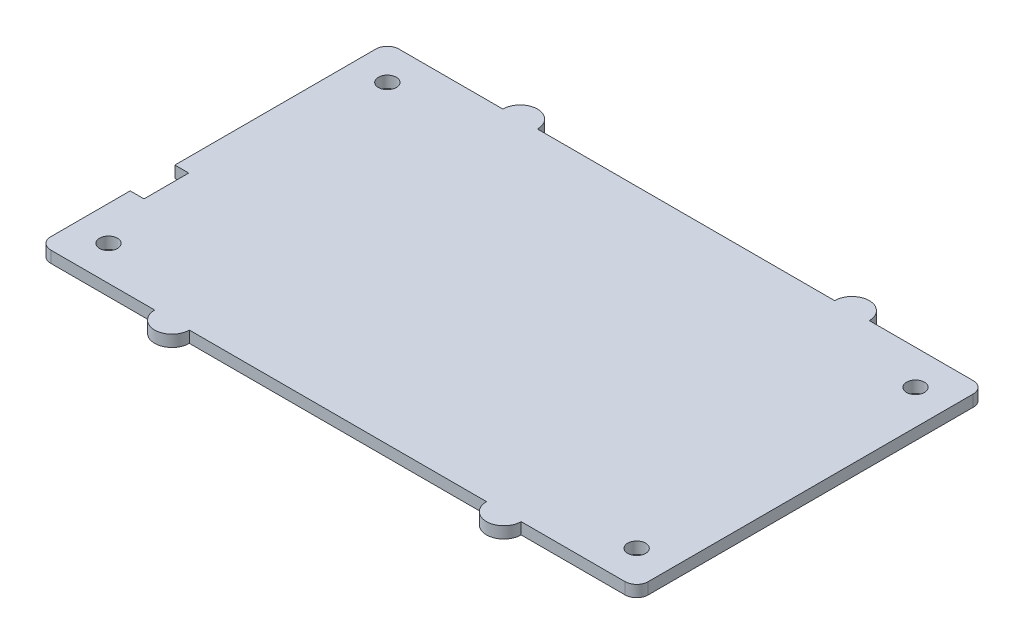
ISO-10303-21;
HEADER;
FILE_DESCRIPTION(('STEP AP214'),'2;1');
FILE_NAME('part.step','',(''),(''),'','','');
FILE_SCHEMA(('AUTOMOTIVE_DESIGN { 1 0 10303 214 1 1 1 1 }'));
ENDSEC;
DATA;
#1=APPLICATION_CONTEXT('core data for automotive mechanical design processes');
#2=APPLICATION_PROTOCOL_DEFINITION('international standard','automotive_design',2000,#1);
#3=PRODUCT_CONTEXT('',#1,'mechanical');
#4=PRODUCT('Part','Part','',(#3));
#5=PRODUCT_RELATED_PRODUCT_CATEGORY('part','',(#4));
#6=PRODUCT_DEFINITION_FORMATION('','',#4);
#7=PRODUCT_DEFINITION_CONTEXT('part definition',#1,'design');
#8=PRODUCT_DEFINITION('design','',#6,#7);
#9=PRODUCT_DEFINITION_SHAPE('','',#8);
#10=(LENGTH_UNIT() NAMED_UNIT(*) SI_UNIT(.MILLI.,.METRE.));
#11=(NAMED_UNIT(*) PLANE_ANGLE_UNIT() SI_UNIT($,.RADIAN.));
#12=(NAMED_UNIT(*) SI_UNIT($,.STERADIAN.) SOLID_ANGLE_UNIT());
#13=UNCERTAINTY_MEASURE_WITH_UNIT(LENGTH_MEASURE(1.E-05),#10,'distance_accuracy_value','');
#14=(GEOMETRIC_REPRESENTATION_CONTEXT(3) GLOBAL_UNCERTAINTY_ASSIGNED_CONTEXT((#13)) GLOBAL_UNIT_ASSIGNED_CONTEXT((#10,
#11,#12)) REPRESENTATION_CONTEXT('',''));
#15=CARTESIAN_POINT('',(0.,0.,0.));
#16=DIRECTION('',(0.,0.,1.));
#17=DIRECTION('',(1.,0.,0.));
#18=AXIS2_PLACEMENT_3D('',#15,#16,#17);
#19=CARTESIAN_POINT('',(0.,2.,0.));
#20=DIRECTION('',(0.,-1.,0.));
#21=DIRECTION('',(0.,0.,-1.));
#22=AXIS2_PLACEMENT_3D('',#19,#20,#21);
#23=CYLINDRICAL_SURFACE('',#22,1.55);
#24=CARTESIAN_POINT('',(0.,2.,0.));
#25=DIRECTION('',(0.,1.,0.));
#26=DIRECTION('',(0.,0.,1.));
#27=AXIS2_PLACEMENT_3D('',#24,#25,#26);
#28=CIRCLE('',#27,1.55);
#29=CARTESIAN_POINT('',(0.,2.,1.55));
#30=VERTEX_POINT('',#29);
#31=EDGE_CURVE('E473',#30,#30,#28,.T.);
#32=ORIENTED_EDGE('',*,*,#31,.T.);
#33=EDGE_LOOP('',(#32));
#34=FACE_BOUND('',#33,.T.);
#35=CARTESIAN_POINT('',(0.,0.,0.));
#36=DIRECTION('',(0.,1.,0.));
#37=DIRECTION('',(0.,0.,1.));
#38=AXIS2_PLACEMENT_3D('',#35,#36,#37);
#39=CIRCLE('',#38,1.55);
#40=CARTESIAN_POINT('',(0.,0.,1.55));
#41=VERTEX_POINT('',#40);
#42=EDGE_CURVE('E458',#41,#41,#39,.T.);
#43=ORIENTED_EDGE('',*,*,#42,.F.);
#44=EDGE_LOOP('',(#43));
#45=FACE_BOUND('',#44,.T.);
#46=ADVANCED_FACE('F287',(#34,#45),#23,.F.);
#47=CARTESIAN_POINT('',(91.46,2.,0.));
#48=DIRECTION('',(0.,-1.,0.));
#49=DIRECTION('',(0.,0.,-1.));
#50=AXIS2_PLACEMENT_3D('',#47,#48,#49);
#51=CYLINDRICAL_SURFACE('',#50,1.54999999999999);
#52=CARTESIAN_POINT('',(91.46,2.,0.));
#53=DIRECTION('',(0.,1.,0.));
#54=DIRECTION('',(0.,0.,1.));
#55=AXIS2_PLACEMENT_3D('',#52,#53,#54);
#56=CIRCLE('',#55,1.54999999999999);
#57=CARTESIAN_POINT('',(91.46,2.,1.54999999999999));
#58=VERTEX_POINT('',#57);
#59=EDGE_CURVE('E890',#58,#58,#56,.T.);
#60=ORIENTED_EDGE('',*,*,#59,.T.);
#61=EDGE_LOOP('',(#60));
#62=FACE_BOUND('',#61,.T.);
#63=CARTESIAN_POINT('',(91.46,0.,0.));
#64=DIRECTION('',(0.,1.,0.));
#65=DIRECTION('',(0.,0.,1.));
#66=AXIS2_PLACEMENT_3D('',#63,#64,#65);
#67=CIRCLE('',#66,1.54999999999999);
#68=CARTESIAN_POINT('',(91.46,0.,1.54999999999999));
#69=VERTEX_POINT('',#68);
#70=EDGE_CURVE('E463',#69,#69,#67,.T.);
#71=ORIENTED_EDGE('',*,*,#70,.F.);
#72=EDGE_LOOP('',(#71));
#73=FACE_BOUND('',#72,.T.);
#74=ADVANCED_FACE('F565',(#62,#73),#51,.F.);
#75=CARTESIAN_POINT('',(91.4599999999998,2.,-48.29));
#76=DIRECTION('',(0.,-1.,0.));
#77=DIRECTION('',(0.,0.,-1.));
#78=AXIS2_PLACEMENT_3D('',#75,#76,#77);
#79=CYLINDRICAL_SURFACE('',#78,1.55);
#80=CARTESIAN_POINT('',(91.4599999999998,2.,-48.29));
#81=DIRECTION('',(0.,1.,0.));
#82=DIRECTION('',(0.,0.,1.));
#83=AXIS2_PLACEMENT_3D('',#80,#81,#82);
#84=CIRCLE('',#83,1.55);
#85=CARTESIAN_POINT('',(91.4599999999998,2.,-46.74));
#86=VERTEX_POINT('',#85);
#87=EDGE_CURVE('E888',#86,#86,#84,.T.);
#88=ORIENTED_EDGE('',*,*,#87,.T.);
#89=EDGE_LOOP('',(#88));
#90=FACE_BOUND('',#89,.T.);
#91=CARTESIAN_POINT('',(91.4599999999998,0.,-48.29));
#92=DIRECTION('',(0.,1.,0.));
#93=DIRECTION('',(0.,0.,1.));
#94=AXIS2_PLACEMENT_3D('',#91,#92,#93);
#95=CIRCLE('',#94,1.55);
#96=CARTESIAN_POINT('',(91.4599999999998,0.,-46.74));
#97=VERTEX_POINT('',#96);
#98=EDGE_CURVE('E468',#97,#97,#95,.T.);
#99=ORIENTED_EDGE('',*,*,#98,.F.);
#100=EDGE_LOOP('',(#99));
#101=FACE_BOUND('',#100,.T.);
#102=ADVANCED_FACE('F562',(#90,#101),#79,.F.);
#103=CARTESIAN_POINT('',(-1.65646724156194E-13,2.,-48.29));
#104=DIRECTION('',(0.,-1.,0.));
#105=DIRECTION('',(0.,0.,-1.));
#106=AXIS2_PLACEMENT_3D('',#103,#104,#105);
#107=CYLINDRICAL_SURFACE('',#106,1.55);
#108=CARTESIAN_POINT('',(-1.65646724156194E-13,2.,-48.29));
#109=DIRECTION('',(0.,1.,0.));
#110=DIRECTION('',(0.,0.,1.));
#111=AXIS2_PLACEMENT_3D('',#108,#109,#110);
#112=CIRCLE('',#111,1.55);
#113=CARTESIAN_POINT('',(-1.65646724156194E-13,2.,-46.74));
#114=VERTEX_POINT('',#113);
#115=EDGE_CURVE('E453',#114,#114,#112,.T.);
#116=ORIENTED_EDGE('',*,*,#115,.T.);
#117=EDGE_LOOP('',(#116));
#118=FACE_BOUND('',#117,.T.);
#119=CARTESIAN_POINT('',(-1.65646724156194E-13,0.,-48.29));
#120=DIRECTION('',(0.,1.,0.));
#121=DIRECTION('',(0.,0.,1.));
#122=AXIS2_PLACEMENT_3D('',#119,#120,#121);
#123=CIRCLE('',#122,1.55);
#124=CARTESIAN_POINT('',(-1.65646724156194E-13,0.,-46.74));
#125=VERTEX_POINT('',#124);
#126=EDGE_CURVE('E544',#125,#125,#123,.T.);
#127=ORIENTED_EDGE('',*,*,#126,.F.);
#128=EDGE_LOOP('',(#127));
#129=FACE_BOUND('',#128,.T.);
#130=ADVANCED_FACE('F564',(#118,#129),#107,.F.);
#131=CARTESIAN_POINT('',(0.,2.,6.));
#132=DIRECTION('',(0.,0.,-1.));
#133=DIRECTION('',(-1.,0.,0.));
#134=AXIS2_PLACEMENT_3D('',#131,#132,#133);
#135=PLANE('',#134);
#136=DIRECTION('',(1.,0.,0.));
#137=VECTOR('',#136,1.);
#138=CARTESIAN_POINT('',(0.,0.,6.));
#139=LINE('',#138,#137);
#140=CARTESIAN_POINT('',(77.46,0.,5.99999999999999));
#141=VERTEX_POINT('',#140);
#142=CARTESIAN_POINT('',(95.46,0.,5.99999999999998));
#143=VERTEX_POINT('',#142);
#144=EDGE_CURVE('E517',#141,#143,#139,.T.);
#145=ORIENTED_EDGE('',*,*,#144,.T.);
#146=DIRECTION('',(0.,-1.,0.));
#147=VECTOR('',#146,1.);
#148=CARTESIAN_POINT('',(95.46,2.,5.99999999999998));
#149=LINE('',#148,#147);
#150=CARTESIAN_POINT('',(95.46,2.,5.99999999999998));
#151=VERTEX_POINT('',#150);
#152=EDGE_CURVE('E297',#151,#143,#149,.T.);
#153=ORIENTED_EDGE('',*,*,#152,.F.);
#154=DIRECTION('',(1.,0.,0.));
#155=VECTOR('',#154,1.);
#156=CARTESIAN_POINT('',(0.,2.,6.));
#157=LINE('',#156,#155);
#158=CARTESIAN_POINT('',(77.46,2.,5.99999999999999));
#159=VERTEX_POINT('',#158);
#160=EDGE_CURVE('E452',#159,#151,#157,.T.);
#161=ORIENTED_EDGE('',*,*,#160,.F.);
#162=DIRECTION('',(0.,-1.,0.));
#163=VECTOR('',#162,1.);
#164=CARTESIAN_POINT('',(77.46,2.,5.99999999999999));
#165=LINE('',#164,#163);
#166=EDGE_CURVE('E12',#159,#141,#165,.T.);
#167=ORIENTED_EDGE('',*,*,#166,.T.);
#168=EDGE_LOOP('',(#145,#153,#161,#167));
#169=FACE_BOUND('',#168,.T.);
#170=ADVANCED_FACE('F572',(#169),#135,.F.);
#171=CARTESIAN_POINT('',(95.46,2.,3.99999999999999));
#172=DIRECTION('',(0.,-1.,0.));
#173=DIRECTION('',(0.,0.,-1.));
#174=AXIS2_PLACEMENT_3D('',#171,#172,#173);
#175=CYLINDRICAL_SURFACE('',#174,2.);
#176=CARTESIAN_POINT('',(95.46,0.,3.99999999999999));
#177=DIRECTION('',(0.,1.,0.));
#178=DIRECTION('',(0.,0.,1.));
#179=AXIS2_PLACEMENT_3D('',#176,#177,#178);
#180=CIRCLE('',#179,2.);
#181=CARTESIAN_POINT('',(97.46,0.,3.99999999999999));
#182=VERTEX_POINT('',#181);
#183=EDGE_CURVE('E537',#143,#182,#180,.T.);
#184=ORIENTED_EDGE('',*,*,#183,.T.);
#185=DIRECTION('',(0.,-1.,0.));
#186=VECTOR('',#185,1.);
#187=CARTESIAN_POINT('',(97.46,2.,3.99999999999999));
#188=LINE('',#187,#186);
#189=CARTESIAN_POINT('',(97.46,2.,3.99999999999999));
#190=VERTEX_POINT('',#189);
#191=EDGE_CURVE('E509',#190,#182,#188,.T.);
#192=ORIENTED_EDGE('',*,*,#191,.F.);
#193=CARTESIAN_POINT('',(95.46,2.,3.99999999999999));
#194=DIRECTION('',(0.,1.,0.));
#195=DIRECTION('',(0.,0.,1.));
#196=AXIS2_PLACEMENT_3D('',#193,#194,#195);
#197=CIRCLE('',#196,2.);
#198=EDGE_CURVE('E457',#151,#190,#197,.T.);
#199=ORIENTED_EDGE('',*,*,#198,.F.);
#200=ORIENTED_EDGE('',*,*,#152,.T.);
#201=EDGE_LOOP('',(#184,#192,#199,#200));
#202=FACE_BOUND('',#201,.T.);
#203=ADVANCED_FACE('F607',(#202),#175,.T.);
#204=CARTESIAN_POINT('',(97.46,2.,0.));
#205=DIRECTION('',(-1.,0.,0.));
#206=DIRECTION('',(0.,0.,1.));
#207=AXIS2_PLACEMENT_3D('',#204,#205,#206);
#208=PLANE('',#207);
#209=DIRECTION('',(0.,0.,-1.));
#210=VECTOR('',#209,1.);
#211=CARTESIAN_POINT('',(97.46,0.,0.));
#212=LINE('',#211,#210);
#213=CARTESIAN_POINT('',(97.46,0.,-52.29));
#214=VERTEX_POINT('',#213);
#215=EDGE_CURVE('E541',#182,#214,#212,.T.);
#216=ORIENTED_EDGE('',*,*,#215,.T.);
#217=DIRECTION('',(0.,-1.,0.));
#218=VECTOR('',#217,1.);
#219=CARTESIAN_POINT('',(97.46,2.,-52.29));
#220=LINE('',#219,#218);
#221=CARTESIAN_POINT('',(97.46,2.,-52.29));
#222=VERTEX_POINT('',#221);
#223=EDGE_CURVE('E506',#222,#214,#220,.T.);
#224=ORIENTED_EDGE('',*,*,#223,.F.);
#225=DIRECTION('',(0.,0.,-1.));
#226=VECTOR('',#225,1.);
#227=CARTESIAN_POINT('',(97.46,2.,0.));
#228=LINE('',#227,#226);
#229=EDGE_CURVE('E461',#190,#222,#228,.T.);
#230=ORIENTED_EDGE('',*,*,#229,.F.);
#231=ORIENTED_EDGE('',*,*,#191,.T.);
#232=EDGE_LOOP('',(#216,#224,#230,#231));
#233=FACE_BOUND('',#232,.T.);
#234=ADVANCED_FACE('F610',(#233),#208,.F.);
#235=CARTESIAN_POINT('',(95.46,2.,-52.29));
#236=DIRECTION('',(0.,-1.,0.));
#237=DIRECTION('',(0.,0.,-1.));
#238=AXIS2_PLACEMENT_3D('',#235,#236,#237);
#239=CYLINDRICAL_SURFACE('',#238,2.);
#240=CARTESIAN_POINT('',(95.46,0.,-52.29));
#241=DIRECTION('',(0.,1.,0.));
#242=DIRECTION('',(0.,0.,1.));
#243=AXIS2_PLACEMENT_3D('',#240,#241,#242);
#244=CIRCLE('',#243,2.);
#245=CARTESIAN_POINT('',(95.46,0.,-54.29));
#246=VERTEX_POINT('',#245);
#247=EDGE_CURVE('E851',#214,#246,#244,.T.);
#248=ORIENTED_EDGE('',*,*,#247,.T.);
#249=DIRECTION('',(0.,-1.,0.));
#250=VECTOR('',#249,1.);
#251=CARTESIAN_POINT('',(95.46,2.,-54.29));
#252=LINE('',#251,#250);
#253=CARTESIAN_POINT('',(95.46,2.,-54.29));
#254=VERTEX_POINT('',#253);
#255=EDGE_CURVE('E503',#254,#246,#252,.T.);
#256=ORIENTED_EDGE('',*,*,#255,.F.);
#257=CARTESIAN_POINT('',(95.46,2.,-52.29));
#258=DIRECTION('',(0.,1.,0.));
#259=DIRECTION('',(0.,0.,1.));
#260=AXIS2_PLACEMENT_3D('',#257,#258,#259);
#261=CIRCLE('',#260,2.);
#262=EDGE_CURVE('E859',#222,#254,#261,.T.);
#263=ORIENTED_EDGE('',*,*,#262,.F.);
#264=ORIENTED_EDGE('',*,*,#223,.T.);
#265=EDGE_LOOP('',(#248,#256,#263,#264));
#266=FACE_BOUND('',#265,.T.);
#267=ADVANCED_FACE('F614',(#266),#239,.T.);
#268=CARTESIAN_POINT('',(0.,2.,-54.29));
#269=DIRECTION('',(0.,0.,1.));
#270=DIRECTION('',(1.,0.,0.));
#271=AXIS2_PLACEMENT_3D('',#268,#269,#270);
#272=PLANE('',#271);
#273=DIRECTION('',(-1.,0.,0.));
#274=VECTOR('',#273,1.);
#275=CARTESIAN_POINT('',(0.,0.,-54.29));
#276=LINE('',#275,#274);
#277=CARTESIAN_POINT('',(77.46,0.,-54.29));
#278=VERTEX_POINT('',#277);
#279=EDGE_CURVE('E847',#246,#278,#276,.T.);
#280=ORIENTED_EDGE('',*,*,#279,.T.);
#281=DIRECTION('',(0.,-1.,0.));
#282=VECTOR('',#281,1.);
#283=CARTESIAN_POINT('',(77.46,2.,-54.29));
#284=LINE('',#283,#282);
#285=CARTESIAN_POINT('',(77.46,2.,-54.29));
#286=VERTEX_POINT('',#285);
#287=EDGE_CURVE('E501',#286,#278,#284,.T.);
#288=ORIENTED_EDGE('',*,*,#287,.F.);
#289=DIRECTION('',(-1.,0.,0.));
#290=VECTOR('',#289,1.);
#291=CARTESIAN_POINT('',(0.,2.,-54.29));
#292=LINE('',#291,#290);
#293=EDGE_CURVE('E866',#254,#286,#292,.T.);
#294=ORIENTED_EDGE('',*,*,#293,.F.);
#295=ORIENTED_EDGE('',*,*,#255,.T.);
#296=EDGE_LOOP('',(#280,#288,#294,#295));
#297=FACE_BOUND('',#296,.T.);
#298=ADVANCED_FACE('F618',(#297),#272,.F.);
#299=CARTESIAN_POINT('',(71.46,0.,-54.29));
#300=VERTEX_POINT('',#299);
#301=CARTESIAN_POINT('',(20.,0.,-54.29));
#302=VERTEX_POINT('',#301);
#303=EDGE_CURVE('E850',#300,#302,#276,.T.);
#304=ORIENTED_EDGE('',*,*,#303,.T.);
#305=DIRECTION('',(0.,-1.,0.));
#306=VECTOR('',#305,1.);
#307=CARTESIAN_POINT('',(20.,2.,-54.29));
#308=LINE('',#307,#306);
#309=CARTESIAN_POINT('',(20.,2.,-54.29));
#310=VERTEX_POINT('',#309);
#311=EDGE_CURVE('E497',#310,#302,#308,.T.);
#312=ORIENTED_EDGE('',*,*,#311,.F.);
#313=CARTESIAN_POINT('',(71.46,2.,-54.29));
#314=VERTEX_POINT('',#313);
#315=EDGE_CURVE('E867',#314,#310,#292,.T.);
#316=ORIENTED_EDGE('',*,*,#315,.F.);
#317=DIRECTION('',(0.,-1.,0.));
#318=VECTOR('',#317,1.);
#319=CARTESIAN_POINT('',(71.46,2.,-54.29));
#320=LINE('',#319,#318);
#321=EDGE_CURVE('E499',#314,#300,#320,.T.);
#322=ORIENTED_EDGE('',*,*,#321,.T.);
#323=EDGE_LOOP('',(#304,#312,#316,#322));
#324=FACE_BOUND('',#323,.T.);
#325=ADVANCED_FACE('F624',(#324),#272,.F.);
#326=CARTESIAN_POINT('',(14.,0.,-54.29));
#327=VERTEX_POINT('',#326);
#328=CARTESIAN_POINT('',(-4.,0.,-54.29));
#329=VERTEX_POINT('',#328);
#330=EDGE_CURVE('E846',#327,#329,#276,.T.);
#331=ORIENTED_EDGE('',*,*,#330,.T.);
#332=DIRECTION('',(0.,-1.,0.));
#333=VECTOR('',#332,1.);
#334=CARTESIAN_POINT('',(-4.,2.,-54.29));
#335=LINE('',#334,#333);
#336=CARTESIAN_POINT('',(-4.,2.,-54.29));
#337=VERTEX_POINT('',#336);
#338=EDGE_CURVE('E492',#337,#329,#335,.T.);
#339=ORIENTED_EDGE('',*,*,#338,.F.);
#340=CARTESIAN_POINT('',(14.,2.,-54.29));
#341=VERTEX_POINT('',#340);
#342=EDGE_CURVE('E869',#341,#337,#292,.T.);
#343=ORIENTED_EDGE('',*,*,#342,.F.);
#344=DIRECTION('',(0.,-1.,0.));
#345=VECTOR('',#344,1.);
#346=CARTESIAN_POINT('',(14.,2.,-54.29));
#347=LINE('',#346,#345);
#348=EDGE_CURVE('E495',#341,#327,#347,.T.);
#349=ORIENTED_EDGE('',*,*,#348,.T.);
#350=EDGE_LOOP('',(#331,#339,#343,#349));
#351=FACE_BOUND('',#350,.T.);
#352=ADVANCED_FACE('F620',(#351),#272,.F.);
#353=CARTESIAN_POINT('',(-4.,2.,-52.29));
#354=DIRECTION('',(0.,-1.,0.));
#355=DIRECTION('',(0.,0.,-1.));
#356=AXIS2_PLACEMENT_3D('',#353,#354,#355);
#357=CYLINDRICAL_SURFACE('',#356,2.);
#358=CARTESIAN_POINT('',(-4.,0.,-52.29));
#359=DIRECTION('',(0.,1.,0.));
#360=DIRECTION('',(0.,0.,1.));
#361=AXIS2_PLACEMENT_3D('',#358,#359,#360);
#362=CIRCLE('',#361,2.);
#363=CARTESIAN_POINT('',(-6.,0.,-52.29));
#364=VERTEX_POINT('',#363);
#365=EDGE_CURVE('E836',#329,#364,#362,.T.);
#366=ORIENTED_EDGE('',*,*,#365,.T.);
#367=DIRECTION('',(0.,-1.,0.));
#368=VECTOR('',#367,1.);
#369=CARTESIAN_POINT('',(-6.,2.,-52.29));
#370=LINE('',#369,#368);
#371=CARTESIAN_POINT('',(-6.,2.,-52.29));
#372=VERTEX_POINT('',#371);
#373=EDGE_CURVE('E489',#372,#364,#370,.T.);
#374=ORIENTED_EDGE('',*,*,#373,.F.);
#375=CARTESIAN_POINT('',(-4.,2.,-52.29));
#376=DIRECTION('',(0.,1.,0.));
#377=DIRECTION('',(0.,0.,1.));
#378=AXIS2_PLACEMENT_3D('',#375,#376,#377);
#379=CIRCLE('',#378,2.);
#380=EDGE_CURVE('E873',#337,#372,#379,.T.);
#381=ORIENTED_EDGE('',*,*,#380,.F.);
#382=ORIENTED_EDGE('',*,*,#338,.T.);
#383=EDGE_LOOP('',(#366,#374,#381,#382));
#384=FACE_BOUND('',#383,.T.);
#385=ADVANCED_FACE('F623',(#384),#357,.T.);
#386=CARTESIAN_POINT('',(-6.,2.,0.));
#387=DIRECTION('',(1.,0.,0.));
#388=DIRECTION('',(0.,0.,-1.));
#389=AXIS2_PLACEMENT_3D('',#386,#387,#388);
#390=PLANE('',#389);
#391=DIRECTION('',(0.,0.,1.));
#392=VECTOR('',#391,1.);
#393=CARTESIAN_POINT('',(-6.,0.,0.));
#394=LINE('',#393,#392);
#395=CARTESIAN_POINT('',(-6.,0.,-17.4938982708781));
#396=VERTEX_POINT('',#395);
#397=EDGE_CURVE('E552',#364,#396,#394,.T.);
#398=ORIENTED_EDGE('',*,*,#397,.T.);
#399=DIRECTION('',(0.,-1.,0.));
#400=VECTOR('',#399,1.);
#401=CARTESIAN_POINT('',(-6.,2.,-17.4938982708781));
#402=LINE('',#401,#400);
#403=CARTESIAN_POINT('',(-6.,2.,-17.4938982708781));
#404=VERTEX_POINT('',#403);
#405=EDGE_CURVE('E486',#404,#396,#402,.T.);
#406=ORIENTED_EDGE('',*,*,#405,.F.);
#407=DIRECTION('',(0.,0.,1.));
#408=VECTOR('',#407,1.);
#409=CARTESIAN_POINT('',(-6.,2.,0.));
#410=LINE('',#409,#408);
#411=EDGE_CURVE('E876',#372,#404,#410,.T.);
#412=ORIENTED_EDGE('',*,*,#411,.F.);
#413=ORIENTED_EDGE('',*,*,#373,.T.);
#414=EDGE_LOOP('',(#398,#406,#412,#413));
#415=FACE_BOUND('',#414,.T.);
#416=ADVANCED_FACE('F628',(#415),#390,.F.);
#417=CARTESIAN_POINT('',(0.,2.,-17.4938982708781));
#418=DIRECTION('',(0.,0.,-1.));
#419=DIRECTION('',(-1.,0.,0.));
#420=AXIS2_PLACEMENT_3D('',#417,#418,#419);
#421=PLANE('',#420);
#422=DIRECTION('',(1.,0.,0.));
#423=VECTOR('',#422,1.);
#424=CARTESIAN_POINT('',(0.,0.,-17.4938982708781));
#425=LINE('',#424,#423);
#426=CARTESIAN_POINT('',(-3.6,0.,-17.4938982708781));
#427=VERTEX_POINT('',#426);
#428=EDGE_CURVE('E835',#396,#427,#425,.T.);
#429=ORIENTED_EDGE('',*,*,#428,.T.);
#430=DIRECTION('',(0.,-1.,0.));
#431=VECTOR('',#430,1.);
#432=CARTESIAN_POINT('',(-3.6,2.,-17.4938982708781));
#433=LINE('',#432,#431);
#434=CARTESIAN_POINT('',(-3.6,2.,-17.4938982708781));
#435=VERTEX_POINT('',#434);
#436=EDGE_CURVE('E483',#435,#427,#433,.T.);
#437=ORIENTED_EDGE('',*,*,#436,.F.);
#438=DIRECTION('',(1.,0.,0.));
#439=VECTOR('',#438,1.);
#440=CARTESIAN_POINT('',(0.,2.,-17.4938982708781));
#441=LINE('',#440,#439);
#442=EDGE_CURVE('E838',#404,#435,#441,.T.);
#443=ORIENTED_EDGE('',*,*,#442,.F.);
#444=ORIENTED_EDGE('',*,*,#405,.T.);
#445=EDGE_LOOP('',(#429,#437,#443,#444));
#446=FACE_BOUND('',#445,.T.);
#447=ADVANCED_FACE('F630',(#446),#421,.F.);
#448=CARTESIAN_POINT('',(-3.59999999999999,2.,0.));
#449=DIRECTION('',(1.,0.,0.));
#450=DIRECTION('',(0.,0.,-1.));
#451=AXIS2_PLACEMENT_3D('',#448,#449,#450);
#452=PLANE('',#451);
#453=DIRECTION('',(0.,0.,1.));
#454=VECTOR('',#453,1.);
#455=CARTESIAN_POINT('',(-3.59999999999999,0.,0.));
#456=LINE('',#455,#454);
#457=CARTESIAN_POINT('',(-3.6,0.,-9.75));
#458=VERTEX_POINT('',#457);
#459=EDGE_CURVE('E842',#427,#458,#456,.T.);
#460=ORIENTED_EDGE('',*,*,#459,.T.);
#461=DIRECTION('',(0.,-1.,0.));
#462=VECTOR('',#461,1.);
#463=CARTESIAN_POINT('',(-3.6,2.,-9.75));
#464=LINE('',#463,#462);
#465=CARTESIAN_POINT('',(-3.6,2.,-9.75));
#466=VERTEX_POINT('',#465);
#467=EDGE_CURVE('E481',#466,#458,#464,.T.);
#468=ORIENTED_EDGE('',*,*,#467,.F.);
#469=DIRECTION('',(0.,0.,1.));
#470=VECTOR('',#469,1.);
#471=CARTESIAN_POINT('',(-3.59999999999999,2.,0.));
#472=LINE('',#471,#470);
#473=EDGE_CURVE('E881',#435,#466,#472,.T.);
#474=ORIENTED_EDGE('',*,*,#473,.F.);
#475=ORIENTED_EDGE('',*,*,#436,.T.);
#476=EDGE_LOOP('',(#460,#468,#474,#475));
#477=FACE_BOUND('',#476,.T.);
#478=ADVANCED_FACE('F633',(#477),#452,.F.);
#479=CARTESIAN_POINT('',(0.,2.,-9.74999999999999));
#480=DIRECTION('',(0.,0.,-1.));
#481=DIRECTION('',(-1.,0.,0.));
#482=AXIS2_PLACEMENT_3D('',#479,#480,#481);
#483=PLANE('',#482);
#484=DIRECTION('',(1.,0.,0.));
#485=VECTOR('',#484,1.);
#486=CARTESIAN_POINT('',(0.,0.,-9.74999999999999));
#487=LINE('',#486,#485);
#488=CARTESIAN_POINT('',(-6.,0.,-9.75000000000001));
#489=VERTEX_POINT('',#488);
#490=EDGE_CURVE('E550',#489,#458,#487,.T.);
#491=ORIENTED_EDGE('',*,*,#490,.F.);
#492=DIRECTION('',(0.,-1.,0.));
#493=VECTOR('',#492,1.);
#494=CARTESIAN_POINT('',(-6.,2.,-9.75000000000001));
#495=LINE('',#494,#493);
#496=CARTESIAN_POINT('',(-6.,2.,-9.75000000000001));
#497=VERTEX_POINT('',#496);
#498=EDGE_CURVE('E479',#497,#489,#495,.T.);
#499=ORIENTED_EDGE('',*,*,#498,.F.);
#500=DIRECTION('',(1.,0.,0.));
#501=VECTOR('',#500,1.);
#502=CARTESIAN_POINT('',(0.,2.,-9.74999999999999));
#503=LINE('',#502,#501);
#504=EDGE_CURVE('E883',#497,#466,#503,.T.);
#505=ORIENTED_EDGE('',*,*,#504,.T.);
#506=ORIENTED_EDGE('',*,*,#467,.T.);
#507=EDGE_LOOP('',(#491,#499,#505,#506));
#508=FACE_BOUND('',#507,.T.);
#509=ADVANCED_FACE('F637',(#508),#483,.T.);
#510=CARTESIAN_POINT('',(-6.,0.,4.));
#511=VERTEX_POINT('',#510);
#512=EDGE_CURVE('E546',#489,#511,#394,.T.);
#513=ORIENTED_EDGE('',*,*,#512,.T.);
#514=DIRECTION('',(0.,-1.,0.));
#515=VECTOR('',#514,1.);
#516=CARTESIAN_POINT('',(-6.,2.,4.));
#517=LINE('',#516,#515);
#518=CARTESIAN_POINT('',(-6.,2.,4.));
#519=VERTEX_POINT('',#518);
#520=EDGE_CURVE('E476',#519,#511,#517,.T.);
#521=ORIENTED_EDGE('',*,*,#520,.F.);
#522=EDGE_CURVE('E454',#497,#519,#410,.T.);
#523=ORIENTED_EDGE('',*,*,#522,.F.);
#524=ORIENTED_EDGE('',*,*,#498,.T.);
#525=EDGE_LOOP('',(#513,#521,#523,#524));
#526=FACE_BOUND('',#525,.T.);
#527=ADVANCED_FACE('F641',(#526),#390,.F.);
#528=CARTESIAN_POINT('',(-4.,2.,4.));
#529=DIRECTION('',(0.,-1.,0.));
#530=DIRECTION('',(0.,0.,-1.));
#531=AXIS2_PLACEMENT_3D('',#528,#529,#530);
#532=CYLINDRICAL_SURFACE('',#531,2.);
#533=CARTESIAN_POINT('',(-4.,0.,4.));
#534=DIRECTION('',(0.,1.,0.));
#535=DIRECTION('',(0.,0.,1.));
#536=AXIS2_PLACEMENT_3D('',#533,#534,#535);
#537=CIRCLE('',#536,2.);
#538=CARTESIAN_POINT('',(-4.,0.,6.));
#539=VERTEX_POINT('',#538);
#540=EDGE_CURVE('E545',#511,#539,#537,.T.);
#541=ORIENTED_EDGE('',*,*,#540,.T.);
#542=DIRECTION('',(0.,-1.,0.));
#543=VECTOR('',#542,1.);
#544=CARTESIAN_POINT('',(-4.,2.,6.));
#545=LINE('',#544,#543);
#546=CARTESIAN_POINT('',(-4.,2.,6.));
#547=VERTEX_POINT('',#546);
#548=EDGE_CURVE('E438',#547,#539,#545,.T.);
#549=ORIENTED_EDGE('',*,*,#548,.F.);
#550=CARTESIAN_POINT('',(-4.,2.,4.));
#551=DIRECTION('',(0.,1.,0.));
#552=DIRECTION('',(0.,0.,1.));
#553=AXIS2_PLACEMENT_3D('',#550,#551,#552);
#554=CIRCLE('',#553,2.);
#555=EDGE_CURVE('E448',#519,#547,#554,.T.);
#556=ORIENTED_EDGE('',*,*,#555,.F.);
#557=ORIENTED_EDGE('',*,*,#520,.T.);
#558=EDGE_LOOP('',(#541,#549,#556,#557));
#559=FACE_BOUND('',#558,.T.);
#560=ADVANCED_FACE('F645',(#559),#532,.T.);
#561=CARTESIAN_POINT('',(14.,0.,6.));
#562=VERTEX_POINT('',#561);
#563=EDGE_CURVE('E435',#539,#562,#139,.T.);
#564=ORIENTED_EDGE('',*,*,#563,.T.);
#565=DIRECTION('',(0.,-1.,0.));
#566=VECTOR('',#565,1.);
#567=CARTESIAN_POINT('',(14.,2.,6.));
#568=LINE('',#567,#566);
#569=CARTESIAN_POINT('',(14.,2.,6.));
#570=VERTEX_POINT('',#569);
#571=EDGE_CURVE('E428',#570,#562,#568,.T.);
#572=ORIENTED_EDGE('',*,*,#571,.F.);
#573=EDGE_CURVE('E433',#547,#570,#157,.T.);
#574=ORIENTED_EDGE('',*,*,#573,.F.);
#575=ORIENTED_EDGE('',*,*,#548,.T.);
#576=EDGE_LOOP('',(#564,#572,#574,#575));
#577=FACE_BOUND('',#576,.T.);
#578=ADVANCED_FACE('F430',(#577),#135,.F.);
#579=CARTESIAN_POINT('',(20.,0.,6.));
#580=VERTEX_POINT('',#579);
#581=CARTESIAN_POINT('',(71.46,0.,5.99999999999999));
#582=VERTEX_POINT('',#581);
#583=EDGE_CURVE('E540',#580,#582,#139,.T.);
#584=ORIENTED_EDGE('',*,*,#583,.T.);
#585=DIRECTION('',(0.,-1.,0.));
#586=VECTOR('',#585,1.);
#587=CARTESIAN_POINT('',(71.46,2.,5.99999999999999));
#588=LINE('',#587,#586);
#589=CARTESIAN_POINT('',(71.46,2.,5.99999999999999));
#590=VERTEX_POINT('',#589);
#591=EDGE_CURVE('E306',#590,#582,#588,.T.);
#592=ORIENTED_EDGE('',*,*,#591,.F.);
#593=CARTESIAN_POINT('',(20.,2.,6.));
#594=VERTEX_POINT('',#593);
#595=EDGE_CURVE('E450',#594,#590,#157,.T.);
#596=ORIENTED_EDGE('',*,*,#595,.F.);
#597=DIRECTION('',(0.,-1.,0.));
#598=VECTOR('',#597,1.);
#599=CARTESIAN_POINT('',(20.,2.,6.));
#600=LINE('',#599,#598);
#601=EDGE_CURVE('E367',#594,#580,#600,.T.);
#602=ORIENTED_EDGE('',*,*,#601,.T.);
#603=EDGE_LOOP('',(#584,#592,#596,#602));
#604=FACE_BOUND('',#603,.T.);
#605=ADVANCED_FACE('F588',(#604),#135,.F.);
#606=CARTESIAN_POINT('',(0.,0.,0.));
#607=DIRECTION('',(0.,1.,0.));
#608=DIRECTION('',(0.,0.,1.));
#609=AXIS2_PLACEMENT_3D('',#606,#607,#608);
#610=PLANE('',#609);
#611=ORIENTED_EDGE('',*,*,#144,.F.);
#612=CARTESIAN_POINT('',(74.46,0.,5.99999999999999));
#613=DIRECTION('',(0.,1.,0.));
#614=DIRECTION('',(0.,0.,1.));
#615=AXIS2_PLACEMENT_3D('',#612,#613,#614);
#616=CIRCLE('',#615,3.00000000000001);
#617=EDGE_CURVE('E444',#582,#141,#616,.T.);
#618=ORIENTED_EDGE('',*,*,#617,.F.);
#619=ORIENTED_EDGE('',*,*,#583,.F.);
#620=CARTESIAN_POINT('',(17.,0.,6.));
#621=DIRECTION('',(0.,1.,0.));
#622=DIRECTION('',(0.,0.,1.));
#623=AXIS2_PLACEMENT_3D('',#620,#621,#622);
#624=CIRCLE('',#623,3.);
#625=EDGE_CURVE('E291',#562,#580,#624,.T.);
#626=ORIENTED_EDGE('',*,*,#625,.F.);
#627=ORIENTED_EDGE('',*,*,#563,.F.);
#628=ORIENTED_EDGE('',*,*,#540,.F.);
#629=ORIENTED_EDGE('',*,*,#512,.F.);
#630=ORIENTED_EDGE('',*,*,#490,.T.);
#631=ORIENTED_EDGE('',*,*,#459,.F.);
#632=ORIENTED_EDGE('',*,*,#428,.F.);
#633=ORIENTED_EDGE('',*,*,#397,.F.);
#634=ORIENTED_EDGE('',*,*,#365,.F.);
#635=ORIENTED_EDGE('',*,*,#330,.F.);
#636=CARTESIAN_POINT('',(17.,0.,-54.29));
#637=DIRECTION('',(0.,1.,0.));
#638=DIRECTION('',(0.,0.,1.));
#639=AXIS2_PLACEMENT_3D('',#636,#637,#638);
#640=CIRCLE('',#639,3.);
#641=EDGE_CURVE('E518',#302,#327,#640,.T.);
#642=ORIENTED_EDGE('',*,*,#641,.F.);
#643=ORIENTED_EDGE('',*,*,#303,.F.);
#644=CARTESIAN_POINT('',(74.46,0.,-54.29));
#645=DIRECTION('',(0.,1.,0.));
#646=DIRECTION('',(0.,0.,1.));
#647=AXIS2_PLACEMENT_3D('',#644,#645,#646);
#648=CIRCLE('',#647,3.00000000000001);
#649=EDGE_CURVE('E524',#278,#300,#648,.T.);
#650=ORIENTED_EDGE('',*,*,#649,.F.);
#651=ORIENTED_EDGE('',*,*,#279,.F.);
#652=ORIENTED_EDGE('',*,*,#247,.F.);
#653=ORIENTED_EDGE('',*,*,#215,.F.);
#654=ORIENTED_EDGE('',*,*,#183,.F.);
#655=EDGE_LOOP('',(#611,#618,#619,#626,#627,#628,#629,#630,#631,#632,#633,#634,#635,#642,#643,
#650,#651,#652,#653,#654));
#656=FACE_BOUND('',#655,.T.);
#657=ORIENTED_EDGE('',*,*,#126,.T.);
#658=EDGE_LOOP('',(#657));
#659=FACE_BOUND('',#658,.T.);
#660=ORIENTED_EDGE('',*,*,#98,.T.);
#661=EDGE_LOOP('',(#660));
#662=FACE_BOUND('',#661,.T.);
#663=ORIENTED_EDGE('',*,*,#70,.T.);
#664=EDGE_LOOP('',(#663));
#665=FACE_BOUND('',#664,.T.);
#666=ORIENTED_EDGE('',*,*,#42,.T.);
#667=EDGE_LOOP('',(#666));
#668=FACE_BOUND('',#667,.T.);
#669=ADVANCED_FACE('F534',(#656,#659,#662,#665,#668),#610,.F.);
#670=CARTESIAN_POINT('',(0.,2.,0.));
#671=DIRECTION('',(0.,1.,0.));
#672=DIRECTION('',(0.,0.,1.));
#673=AXIS2_PLACEMENT_3D('',#670,#671,#672);
#674=PLANE('',#673);
#675=ORIENTED_EDGE('',*,*,#595,.T.);
#676=CARTESIAN_POINT('',(74.46,2.,5.99999999999999));
#677=DIRECTION('',(0.,1.,0.));
#678=DIRECTION('',(0.,0.,1.));
#679=AXIS2_PLACEMENT_3D('',#676,#677,#678);
#680=CIRCLE('',#679,3.00000000000001);
#681=EDGE_CURVE('E527',#590,#159,#680,.T.);
#682=ORIENTED_EDGE('',*,*,#681,.T.);
#683=ORIENTED_EDGE('',*,*,#160,.T.);
#684=ORIENTED_EDGE('',*,*,#198,.T.);
#685=ORIENTED_EDGE('',*,*,#229,.T.);
#686=ORIENTED_EDGE('',*,*,#262,.T.);
#687=ORIENTED_EDGE('',*,*,#293,.T.);
#688=CARTESIAN_POINT('',(74.46,2.,-54.29));
#689=DIRECTION('',(0.,1.,0.));
#690=DIRECTION('',(0.,0.,1.));
#691=AXIS2_PLACEMENT_3D('',#688,#689,#690);
#692=CIRCLE('',#691,3.00000000000001);
#693=EDGE_CURVE('E521',#286,#314,#692,.T.);
#694=ORIENTED_EDGE('',*,*,#693,.T.);
#695=ORIENTED_EDGE('',*,*,#315,.T.);
#696=CARTESIAN_POINT('',(17.,2.,-54.29));
#697=DIRECTION('',(0.,1.,0.));
#698=DIRECTION('',(0.,0.,1.));
#699=AXIS2_PLACEMENT_3D('',#696,#697,#698);
#700=CIRCLE('',#699,3.);
#701=EDGE_CURVE('E514',#310,#341,#700,.T.);
#702=ORIENTED_EDGE('',*,*,#701,.T.);
#703=ORIENTED_EDGE('',*,*,#342,.T.);
#704=ORIENTED_EDGE('',*,*,#380,.T.);
#705=ORIENTED_EDGE('',*,*,#411,.T.);
#706=ORIENTED_EDGE('',*,*,#442,.T.);
#707=ORIENTED_EDGE('',*,*,#473,.T.);
#708=ORIENTED_EDGE('',*,*,#504,.F.);
#709=ORIENTED_EDGE('',*,*,#522,.T.);
#710=ORIENTED_EDGE('',*,*,#555,.T.);
#711=ORIENTED_EDGE('',*,*,#573,.T.);
#712=CARTESIAN_POINT('',(17.,2.,6.));
#713=DIRECTION('',(0.,1.,0.));
#714=DIRECTION('',(0.,0.,1.));
#715=AXIS2_PLACEMENT_3D('',#712,#713,#714);
#716=CIRCLE('',#715,3.);
#717=EDGE_CURVE('E441',#570,#594,#716,.T.);
#718=ORIENTED_EDGE('',*,*,#717,.T.);
#719=EDGE_LOOP('',(#675,#682,#683,#684,#685,#686,#687,#694,#695,#702,#703,#704,#705,#706,#707,
#708,#709,#710,#711,#718));
#720=FACE_BOUND('',#719,.T.);
#721=ORIENTED_EDGE('',*,*,#115,.F.);
#722=EDGE_LOOP('',(#721));
#723=FACE_BOUND('',#722,.T.);
#724=ORIENTED_EDGE('',*,*,#87,.F.);
#725=EDGE_LOOP('',(#724));
#726=FACE_BOUND('',#725,.T.);
#727=ORIENTED_EDGE('',*,*,#59,.F.);
#728=EDGE_LOOP('',(#727));
#729=FACE_BOUND('',#728,.T.);
#730=ORIENTED_EDGE('',*,*,#31,.F.);
#731=EDGE_LOOP('',(#730));
#732=FACE_BOUND('',#731,.T.);
#733=ADVANCED_FACE('F445',(#720,#723,#726,#729,#732),#674,.T.);
#734=CARTESIAN_POINT('',(17.,2.,6.));
#735=DIRECTION('',(0.,-1.,0.));
#736=DIRECTION('',(0.,0.,-1.));
#737=AXIS2_PLACEMENT_3D('',#734,#735,#736);
#738=CYLINDRICAL_SURFACE('',#737,3.);
#739=ORIENTED_EDGE('',*,*,#717,.F.);
#740=ORIENTED_EDGE('',*,*,#571,.T.);
#741=ORIENTED_EDGE('',*,*,#625,.T.);
#742=ORIENTED_EDGE('',*,*,#601,.F.);
#743=EDGE_LOOP('',(#739,#740,#741,#742));
#744=FACE_BOUND('',#743,.T.);
#745=ADVANCED_FACE('F289',(#744),#738,.T.);
#746=CARTESIAN_POINT('',(74.46,2.,5.99999999999999));
#747=DIRECTION('',(0.,-1.,0.));
#748=DIRECTION('',(0.,0.,-1.));
#749=AXIS2_PLACEMENT_3D('',#746,#747,#748);
#750=CYLINDRICAL_SURFACE('',#749,3.00000000000001);
#751=ORIENTED_EDGE('',*,*,#617,.T.);
#752=ORIENTED_EDGE('',*,*,#166,.F.);
#753=ORIENTED_EDGE('',*,*,#681,.F.);
#754=ORIENTED_EDGE('',*,*,#591,.T.);
#755=EDGE_LOOP('',(#751,#752,#753,#754));
#756=FACE_BOUND('',#755,.T.);
#757=ADVANCED_FACE('F530',(#756),#750,.T.);
#758=CARTESIAN_POINT('',(74.46,2.,-54.29));
#759=DIRECTION('',(0.,-1.,0.));
#760=DIRECTION('',(0.,0.,-1.));
#761=AXIS2_PLACEMENT_3D('',#758,#759,#760);
#762=CYLINDRICAL_SURFACE('',#761,3.00000000000001);
#763=ORIENTED_EDGE('',*,*,#693,.F.);
#764=ORIENTED_EDGE('',*,*,#287,.T.);
#765=ORIENTED_EDGE('',*,*,#649,.T.);
#766=ORIENTED_EDGE('',*,*,#321,.F.);
#767=EDGE_LOOP('',(#763,#764,#765,#766));
#768=FACE_BOUND('',#767,.T.);
#769=ADVANCED_FACE('F596',(#768),#762,.T.);
#770=CARTESIAN_POINT('',(17.,2.,-54.29));
#771=DIRECTION('',(0.,-1.,0.));
#772=DIRECTION('',(0.,0.,-1.));
#773=AXIS2_PLACEMENT_3D('',#770,#771,#772);
#774=CYLINDRICAL_SURFACE('',#773,3.);
#775=ORIENTED_EDGE('',*,*,#701,.F.);
#776=ORIENTED_EDGE('',*,*,#311,.T.);
#777=ORIENTED_EDGE('',*,*,#641,.T.);
#778=ORIENTED_EDGE('',*,*,#348,.F.);
#779=EDGE_LOOP('',(#775,#776,#777,#778));
#780=FACE_BOUND('',#779,.T.);
#781=ADVANCED_FACE('F600',(#780),#774,.T.);
#782=CLOSED_SHELL('',(#46,#74,#102,#130,#170,#203,#234,#267,#298,#325,#352,#385,#416,#447,#478,
#509,#527,#560,#578,#605,#669,#733,#745,#757,#769,#781));
#783=MANIFOLD_SOLID_BREP('B2',#782);
#784=ADVANCED_BREP_SHAPE_REPRESENTATION('',(#18,#783),#14);
#785=SHAPE_DEFINITION_REPRESENTATION(#9,#784);
ENDSEC;
END-ISO-10303-21;
